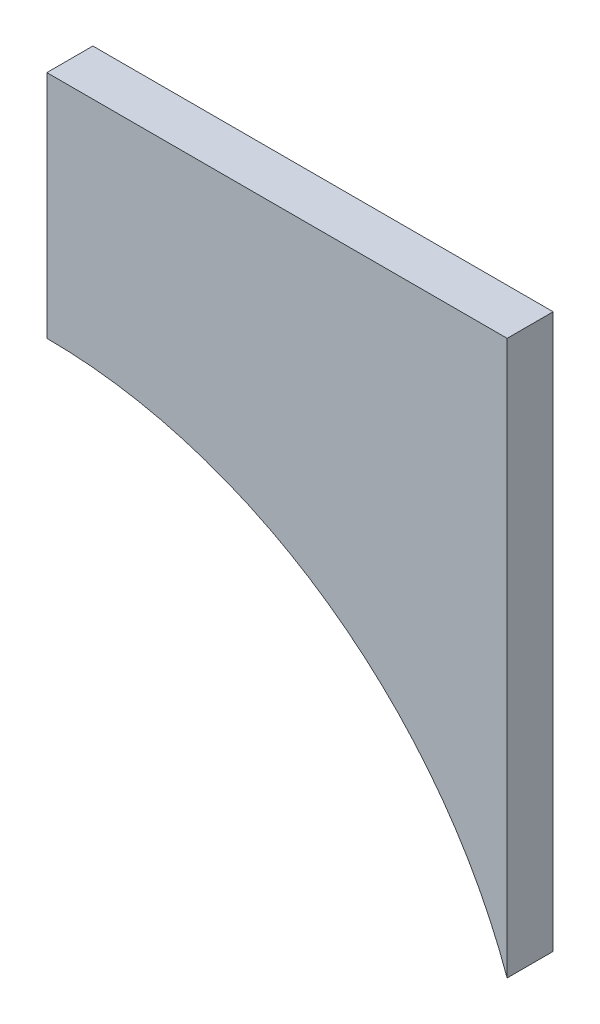
ISO-10303-21;
HEADER;
FILE_DESCRIPTION(('STEP AP214'),'2;1');
FILE_NAME('part.step','',(''),(''),'','','');
FILE_SCHEMA(('AUTOMOTIVE_DESIGN { 1 0 10303 214 1 1 1 1 }'));
ENDSEC;
DATA;
#1=APPLICATION_CONTEXT('core data for automotive mechanical design processes');
#2=APPLICATION_PROTOCOL_DEFINITION('international standard','automotive_design',2000,#1);
#3=PRODUCT_CONTEXT('',#1,'mechanical');
#4=PRODUCT('Part','Part','',(#3));
#5=PRODUCT_RELATED_PRODUCT_CATEGORY('part','',(#4));
#6=PRODUCT_DEFINITION_FORMATION('','',#4);
#7=PRODUCT_DEFINITION_CONTEXT('part definition',#1,'design');
#8=PRODUCT_DEFINITION('design','',#6,#7);
#9=PRODUCT_DEFINITION_SHAPE('','',#8);
#10=(LENGTH_UNIT() NAMED_UNIT(*) SI_UNIT(.MILLI.,.METRE.));
#11=(NAMED_UNIT(*) PLANE_ANGLE_UNIT() SI_UNIT($,.RADIAN.));
#12=(NAMED_UNIT(*) SI_UNIT($,.STERADIAN.) SOLID_ANGLE_UNIT());
#13=UNCERTAINTY_MEASURE_WITH_UNIT(LENGTH_MEASURE(1.E-05),#10,'distance_accuracy_value','');
#14=(GEOMETRIC_REPRESENTATION_CONTEXT(3) GLOBAL_UNCERTAINTY_ASSIGNED_CONTEXT((#13)) GLOBAL_UNIT_ASSIGNED_CONTEXT((#10,
#11,#12)) REPRESENTATION_CONTEXT('',''));
#15=CARTESIAN_POINT('',(0.,0.,0.));
#16=DIRECTION('',(0.,0.,1.));
#17=DIRECTION('',(1.,0.,0.));
#18=AXIS2_PLACEMENT_3D('',#15,#16,#17);
#19=CARTESIAN_POINT('',(-0.2,-0.525,0.));
#20=DIRECTION('',(0.,0.,-1.));
#21=DIRECTION('',(-1.,0.,0.));
#22=AXIS2_PLACEMENT_3D('',#19,#20,#21);
#23=PLANE('',#22);
#24=DIRECTION('',(1.,0.,0.));
#25=VECTOR('',#24,1.);
#26=CARTESIAN_POINT('',(0.2,0.1,0.));
#27=LINE('',#26,#25);
#28=CARTESIAN_POINT('',(-0.2,0.1,0.));
#29=VERTEX_POINT('',#28);
#30=CARTESIAN_POINT('',(0.2,0.1,0.));
#31=VERTEX_POINT('',#30);
#32=EDGE_CURVE('E60',#29,#31,#27,.T.);
#33=ORIENTED_EDGE('',*,*,#32,.T.);
#34=DIRECTION('',(0.,-1.,0.));
#35=VECTOR('',#34,1.);
#36=CARTESIAN_POINT('',(0.2,-0.381385933837,0.));
#37=LINE('',#36,#35);
#38=CARTESIAN_POINT('',(0.200000000000072,-0.381385933836749,0.));
#39=VERTEX_POINT('',#38);
#40=EDGE_CURVE('E49',#31,#39,#37,.T.);
#41=ORIENTED_EDGE('',*,*,#40,.T.);
#42=CARTESIAN_POINT('',(-0.2,-0.525,0.));
#43=DIRECTION('',(0.,0.,1.));
#44=DIRECTION('',(1.,0.,0.));
#45=AXIS2_PLACEMENT_3D('',#42,#43,#44);
#46=CIRCLE('',#45,0.425);
#47=CARTESIAN_POINT('',(-0.2,-0.1,0.));
#48=VERTEX_POINT('',#47);
#49=EDGE_CURVE('E19',#39,#48,#46,.T.);
#50=ORIENTED_EDGE('',*,*,#49,.T.);
#51=DIRECTION('',(0.,1.,0.));
#52=VECTOR('',#51,1.);
#53=CARTESIAN_POINT('',(-0.2,0.1,0.));
#54=LINE('',#53,#52);
#55=EDGE_CURVE('E56',#48,#29,#54,.T.);
#56=ORIENTED_EDGE('',*,*,#55,.T.);
#57=EDGE_LOOP('',(#33,#41,#50,#56));
#58=FACE_BOUND('',#57,.T.);
#59=ADVANCED_FACE('F16',(#58),#23,.T.);
#60=CARTESIAN_POINT('',(-0.2,0.1,0.04));
#61=DIRECTION('',(1.,0.,0.));
#62=DIRECTION('',(0.,0.,-1.));
#63=AXIS2_PLACEMENT_3D('',#60,#61,#62);
#64=PLANE('',#63);
#65=DIRECTION('',(0.,0.,1.));
#66=VECTOR('',#65,1.);
#67=CARTESIAN_POINT('',(-0.2,-0.1,0.04));
#68=LINE('',#67,#66);
#69=CARTESIAN_POINT('',(-0.2,-0.1,0.04));
#70=VERTEX_POINT('',#69);
#71=EDGE_CURVE('E78',#48,#70,#68,.T.);
#72=ORIENTED_EDGE('',*,*,#71,.T.);
#73=DIRECTION('',(0.,1.,0.));
#74=VECTOR('',#73,1.);
#75=CARTESIAN_POINT('',(-0.2,-0.525,0.04));
#76=LINE('',#75,#74);
#77=CARTESIAN_POINT('',(-0.2,0.1,0.04));
#78=VERTEX_POINT('',#77);
#79=EDGE_CURVE('E74',#70,#78,#76,.T.);
#80=ORIENTED_EDGE('',*,*,#79,.T.);
#81=DIRECTION('',(0.,0.,1.));
#82=VECTOR('',#81,1.);
#83=CARTESIAN_POINT('',(-0.2,0.1,0.04));
#84=LINE('',#83,#82);
#85=EDGE_CURVE('E64',#78,#29,#84,.F.);
#86=ORIENTED_EDGE('',*,*,#85,.T.);
#87=ORIENTED_EDGE('',*,*,#55,.F.);
#88=EDGE_LOOP('',(#72,#80,#86,#87));
#89=FACE_BOUND('',#88,.T.);
#90=ADVANCED_FACE('F77',(#89),#64,.F.);
#91=CARTESIAN_POINT('',(0.2,0.1,0.04));
#92=DIRECTION('',(0.,-1.,0.));
#93=DIRECTION('',(1.,0.,0.));
#94=AXIS2_PLACEMENT_3D('',#91,#92,#93);
#95=PLANE('',#94);
#96=ORIENTED_EDGE('',*,*,#85,.F.);
#97=DIRECTION('',(-1.,0.,0.));
#98=VECTOR('',#97,1.);
#99=CARTESIAN_POINT('',(-0.2,0.1,0.04));
#100=LINE('',#99,#98);
#101=CARTESIAN_POINT('',(0.2,0.1,0.04));
#102=VERTEX_POINT('',#101);
#103=EDGE_CURVE('E68',#78,#102,#100,.F.);
#104=ORIENTED_EDGE('',*,*,#103,.T.);
#105=DIRECTION('',(0.,0.,1.));
#106=VECTOR('',#105,1.);
#107=CARTESIAN_POINT('',(0.2,0.1,0.04));
#108=LINE('',#107,#106);
#109=EDGE_CURVE('E88',#102,#31,#108,.F.);
#110=ORIENTED_EDGE('',*,*,#109,.T.);
#111=ORIENTED_EDGE('',*,*,#32,.F.);
#112=EDGE_LOOP('',(#96,#104,#110,#111));
#113=FACE_BOUND('',#112,.T.);
#114=ADVANCED_FACE('F66',(#113),#95,.F.);
#115=CARTESIAN_POINT('',(0.2,-0.381385933837,0.04));
#116=DIRECTION('',(-1.,0.,0.));
#117=DIRECTION('',(0.,-1.,0.));
#118=AXIS2_PLACEMENT_3D('',#115,#116,#117);
#119=PLANE('',#118);
#120=ORIENTED_EDGE('',*,*,#109,.F.);
#121=DIRECTION('',(0.,1.,0.));
#122=VECTOR('',#121,1.);
#123=CARTESIAN_POINT('',(0.2,-0.525,0.04));
#124=LINE('',#123,#122);
#125=CARTESIAN_POINT('',(0.200000000000072,-0.381385933836749,0.04));
#126=VERTEX_POINT('',#125);
#127=EDGE_CURVE('E25',#102,#126,#124,.F.);
#128=ORIENTED_EDGE('',*,*,#127,.T.);
#129=DIRECTION('',(0.,0.,1.));
#130=VECTOR('',#129,1.);
#131=CARTESIAN_POINT('',(0.200000000000143,-0.381385933836949,0.04));
#132=LINE('',#131,#130);
#133=EDGE_CURVE('E32',#126,#39,#132,.F.);
#134=ORIENTED_EDGE('',*,*,#133,.T.);
#135=ORIENTED_EDGE('',*,*,#40,.F.);
#136=EDGE_LOOP('',(#120,#128,#134,#135));
#137=FACE_BOUND('',#136,.T.);
#138=ADVANCED_FACE('F106',(#137),#119,.F.);
#139=CARTESIAN_POINT('',(-0.2,-0.525,0.04));
#140=DIRECTION('',(0.,0.,1.));
#141=DIRECTION('',(1.,0.,0.));
#142=AXIS2_PLACEMENT_3D('',#139,#140,#141);
#143=CYLINDRICAL_SURFACE('',#142,0.425);
#144=ORIENTED_EDGE('',*,*,#133,.F.);
#145=CARTESIAN_POINT('',(-0.2,-0.525,0.04));
#146=DIRECTION('',(0.,0.,1.));
#147=DIRECTION('',(1.,0.,0.));
#148=AXIS2_PLACEMENT_3D('',#145,#146,#147);
#149=CIRCLE('',#148,0.425);
#150=EDGE_CURVE('E11',#126,#70,#149,.T.);
#151=ORIENTED_EDGE('',*,*,#150,.T.);
#152=ORIENTED_EDGE('',*,*,#71,.F.);
#153=ORIENTED_EDGE('',*,*,#49,.F.);
#154=EDGE_LOOP('',(#144,#151,#152,#153));
#155=FACE_BOUND('',#154,.T.);
#156=ADVANCED_FACE('F104',(#155),#143,.F.);
#157=CARTESIAN_POINT('',(-0.2,-0.525,0.04));
#158=DIRECTION('',(0.,0.,-1.));
#159=DIRECTION('',(-1.,0.,0.));
#160=AXIS2_PLACEMENT_3D('',#157,#158,#159);
#161=PLANE('',#160);
#162=ORIENTED_EDGE('',*,*,#127,.F.);
#163=ORIENTED_EDGE('',*,*,#103,.F.);
#164=ORIENTED_EDGE('',*,*,#79,.F.);
#165=ORIENTED_EDGE('',*,*,#150,.F.);
#166=EDGE_LOOP('',(#162,#163,#164,#165));
#167=FACE_BOUND('',#166,.T.);
#168=ADVANCED_FACE('F73',(#167),#161,.F.);
#169=CLOSED_SHELL('',(#59,#90,#114,#138,#156,#168));
#170=MANIFOLD_SOLID_BREP('B1',#169);
#171=ADVANCED_BREP_SHAPE_REPRESENTATION('',(#18,#170),#14);
#172=SHAPE_DEFINITION_REPRESENTATION(#9,#171);
ENDSEC;
END-ISO-10303-21;
